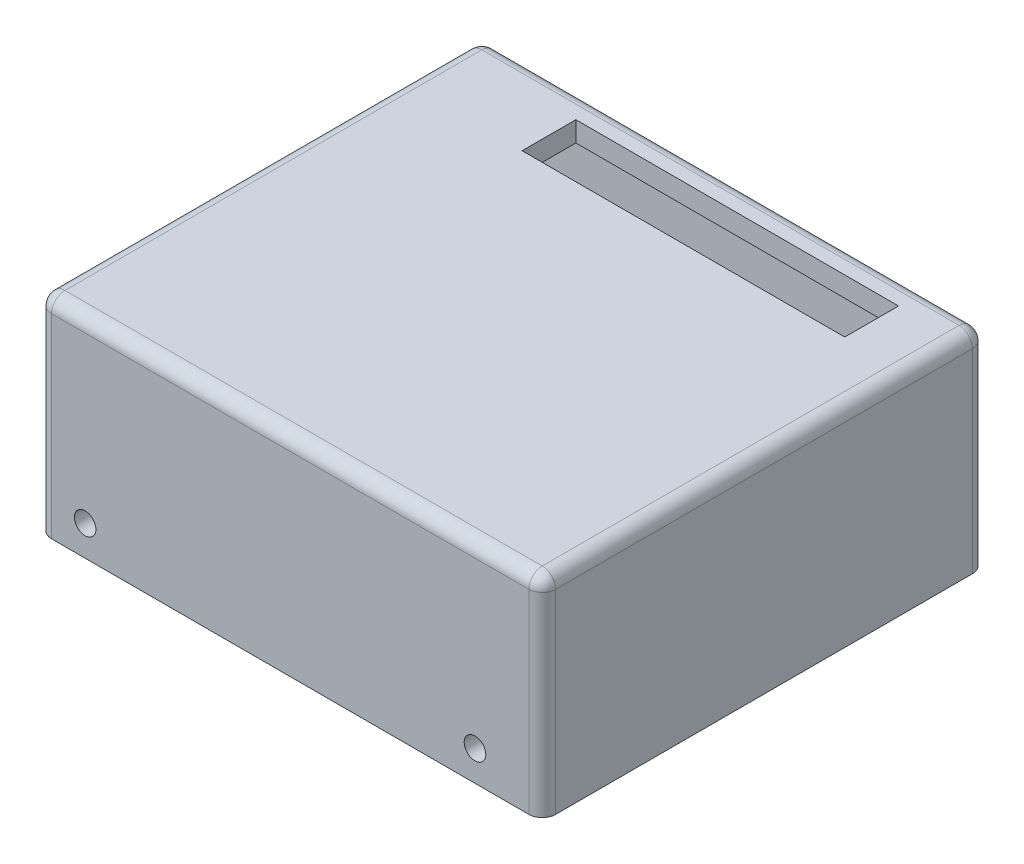
ISO-10303-21;
HEADER;
FILE_DESCRIPTION(('STEP AP214'),'2;1');
FILE_NAME('part.step','',(''),(''),'','','');
FILE_SCHEMA(('AUTOMOTIVE_DESIGN { 1 0 10303 214 1 1 1 1 }'));
ENDSEC;
DATA;
#1=APPLICATION_CONTEXT('core data for automotive mechanical design processes');
#2=APPLICATION_PROTOCOL_DEFINITION('international standard','automotive_design',2000,#1);
#3=PRODUCT_CONTEXT('',#1,'mechanical');
#4=PRODUCT('Part','Part','',(#3));
#5=PRODUCT_RELATED_PRODUCT_CATEGORY('part','',(#4));
#6=PRODUCT_DEFINITION_FORMATION('','',#4);
#7=PRODUCT_DEFINITION_CONTEXT('part definition',#1,'design');
#8=PRODUCT_DEFINITION('design','',#6,#7);
#9=PRODUCT_DEFINITION_SHAPE('','',#8);
#10=(LENGTH_UNIT() NAMED_UNIT(*) SI_UNIT(.MILLI.,.METRE.));
#11=(NAMED_UNIT(*) PLANE_ANGLE_UNIT() SI_UNIT($,.RADIAN.));
#12=(NAMED_UNIT(*) SI_UNIT($,.STERADIAN.) SOLID_ANGLE_UNIT());
#13=UNCERTAINTY_MEASURE_WITH_UNIT(LENGTH_MEASURE(1.E-05),#10,'distance_accuracy_value','');
#14=(GEOMETRIC_REPRESENTATION_CONTEXT(3) GLOBAL_UNCERTAINTY_ASSIGNED_CONTEXT((#13)) GLOBAL_UNIT_ASSIGNED_CONTEXT((#10,
#11,#12)) REPRESENTATION_CONTEXT('',''));
#15=CARTESIAN_POINT('',(0.,0.,0.));
#16=DIRECTION('',(0.,0.,1.));
#17=DIRECTION('',(1.,0.,0.));
#18=AXIS2_PLACEMENT_3D('',#15,#16,#17);
#19=CARTESIAN_POINT('',(3.,24.,0.));
#20=DIRECTION('',(0.,1.,0.));
#21=DIRECTION('',(0.,0.,1.));
#22=AXIS2_PLACEMENT_3D('',#19,#20,#21);
#23=PLANE('',#22);
#24=DIRECTION('',(0.,0.,-1.));
#25=VECTOR('',#24,1.);
#26=CARTESIAN_POINT('',(0.,24.,0.));
#27=LINE('',#26,#25);
#28=CARTESIAN_POINT('',(0.,24.,57.));
#29=VERTEX_POINT('',#28);
#30=CARTESIAN_POINT('',(0.,24.,44.));
#31=VERTEX_POINT('',#30);
#32=EDGE_CURVE('E432',#29,#31,#27,.T.);
#33=ORIENTED_EDGE('',*,*,#32,.T.);
#34=DIRECTION('',(-1.,0.,0.));
#35=VECTOR('',#34,1.);
#36=CARTESIAN_POINT('',(3.,24.,44.));
#37=LINE('',#36,#35);
#38=CARTESIAN_POINT('',(3.,24.,44.));
#39=VERTEX_POINT('',#38);
#40=EDGE_CURVE('E312',#31,#39,#37,.F.);
#41=ORIENTED_EDGE('',*,*,#40,.T.);
#42=DIRECTION('',(0.,0.,-1.));
#43=VECTOR('',#42,1.);
#44=CARTESIAN_POINT('',(3.,24.,0.));
#45=LINE('',#44,#43);
#46=CARTESIAN_POINT('',(3.,24.,57.));
#47=VERTEX_POINT('',#46);
#48=EDGE_CURVE('E254',#47,#39,#45,.T.);
#49=ORIENTED_EDGE('',*,*,#48,.F.);
#50=DIRECTION('',(-1.,0.,0.));
#51=VECTOR('',#50,1.);
#52=CARTESIAN_POINT('',(0.,24.,57.));
#53=LINE('',#52,#51);
#54=EDGE_CURVE('E309',#47,#29,#53,.T.);
#55=ORIENTED_EDGE('',*,*,#54,.T.);
#56=EDGE_LOOP('',(#33,#41,#49,#55));
#57=FACE_BOUND('',#56,.T.);
#58=ADVANCED_FACE('F63',(#57),#23,.F.);
#59=CARTESIAN_POINT('',(0.,28.,58.));
#60=DIRECTION('',(0.,0.,1.));
#61=DIRECTION('',(1.,0.,0.));
#62=AXIS2_PLACEMENT_3D('',#59,#60,#61);
#63=PLANE('',#62);
#64=CARTESIAN_POINT('',(64.9945547397337,4.49861656227081,58.));
#65=DIRECTION('',(0.,0.,-1.));
#66=DIRECTION('',(-1.,0.,0.));
#67=AXIS2_PLACEMENT_3D('',#64,#65,#66);
#68=CIRCLE('',#67,1.60561825233664);
#69=CARTESIAN_POINT('',(63.388936487397,4.49861656227081,58.));
#70=VERTEX_POINT('',#69);
#71=EDGE_CURVE('E405',#70,#70,#68,.T.);
#72=ORIENTED_EDGE('',*,*,#71,.F.);
#73=EDGE_LOOP('',(#72));
#74=FACE_BOUND('',#73,.T.);
#75=CARTESIAN_POINT('',(7.,4.5,58.));
#76=DIRECTION('',(0.,0.,-1.));
#77=DIRECTION('',(-1.,0.,0.));
#78=AXIS2_PLACEMENT_3D('',#75,#76,#77);
#79=CIRCLE('',#78,1.59999999999075);
#80=CARTESIAN_POINT('',(5.40000000000925,4.5,58.));
#81=VERTEX_POINT('',#80);
#82=EDGE_CURVE('E421',#81,#81,#79,.T.);
#83=ORIENTED_EDGE('',*,*,#82,.F.);
#84=EDGE_LOOP('',(#83));
#85=FACE_BOUND('',#84,.T.);
#86=DIRECTION('',(0.,-1.,0.));
#87=VECTOR('',#86,1.);
#88=CARTESIAN_POINT('',(0.,28.,58.));
#89=LINE('',#88,#87);
#90=CARTESIAN_POINT('',(0.,23.,58.));
#91=VERTEX_POINT('',#90);
#92=CARTESIAN_POINT('',(0.,0.,58.));
#93=VERTEX_POINT('',#92);
#94=EDGE_CURVE('E278',#91,#93,#89,.T.);
#95=ORIENTED_EDGE('',*,*,#94,.F.);
#96=DIRECTION('',(-1.,0.,0.));
#97=VECTOR('',#96,1.);
#98=CARTESIAN_POINT('',(3.,23.,58.));
#99=LINE('',#98,#97);
#100=CARTESIAN_POINT('',(3.,23.,58.));
#101=VERTEX_POINT('',#100);
#102=EDGE_CURVE('E252',#91,#101,#99,.F.);
#103=ORIENTED_EDGE('',*,*,#102,.T.);
#104=DIRECTION('',(0.,-1.,0.));
#105=VECTOR('',#104,1.);
#106=CARTESIAN_POINT('',(3.,0.,58.));
#107=LINE('',#106,#105);
#108=CARTESIAN_POINT('',(3.,28.,58.));
#109=VERTEX_POINT('',#108);
#110=EDGE_CURVE('E237',#109,#101,#107,.T.);
#111=ORIENTED_EDGE('',*,*,#110,.F.);
#112=DIRECTION('',(-1.,0.,0.));
#113=VECTOR('',#112,1.);
#114=CARTESIAN_POINT('',(0.,28.,58.));
#115=LINE('',#114,#113);
#116=CARTESIAN_POINT('',(72.,28.,58.));
#117=VERTEX_POINT('',#116);
#118=EDGE_CURVE('E249',#117,#109,#115,.T.);
#119=ORIENTED_EDGE('',*,*,#118,.F.);
#120=DIRECTION('',(0.,-1.,0.));
#121=VECTOR('',#120,1.);
#122=CARTESIAN_POINT('',(72.,28.,58.));
#123=LINE('',#122,#121);
#124=CARTESIAN_POINT('',(72.,0.,58.));
#125=VERTEX_POINT('',#124);
#126=EDGE_CURVE('E281',#117,#125,#123,.T.);
#127=ORIENTED_EDGE('',*,*,#126,.T.);
#128=DIRECTION('',(-1.,0.,0.));
#129=VECTOR('',#128,1.);
#130=CARTESIAN_POINT('',(0.,0.,58.));
#131=LINE('',#130,#129);
#132=EDGE_CURVE('E275',#125,#93,#131,.T.);
#133=ORIENTED_EDGE('',*,*,#132,.T.);
#134=EDGE_LOOP('',(#95,#103,#111,#119,#127,#133));
#135=FACE_BOUND('',#134,.T.);
#136=ADVANCED_FACE('F248',(#74,#85,#135),#63,.F.);
#137=CARTESIAN_POINT('',(0.,28.,-1.99999999999999));
#138=DIRECTION('',(0.,0.,-1.));
#139=DIRECTION('',(-1.,0.,0.));
#140=AXIS2_PLACEMENT_3D('',#137,#138,#139);
#141=PLANE('',#140);
#142=CARTESIAN_POINT('',(64.9945547397337,4.49861656227081,-1.99999999999999));
#143=DIRECTION('',(0.,0.,-1.));
#144=DIRECTION('',(-1.,0.,0.));
#145=AXIS2_PLACEMENT_3D('',#142,#143,#144);
#146=CIRCLE('',#145,1.60561825233664);
#147=CARTESIAN_POINT('',(63.388936487397,4.49861656227081,-1.99999999999999));
#148=VERTEX_POINT('',#147);
#149=EDGE_CURVE('E417',#148,#148,#146,.F.);
#150=ORIENTED_EDGE('',*,*,#149,.F.);
#151=EDGE_LOOP('',(#150));
#152=FACE_BOUND('',#151,.T.);
#153=CARTESIAN_POINT('',(7.,4.5,-1.99999999999999));
#154=DIRECTION('',(0.,0.,-1.));
#155=DIRECTION('',(-1.,0.,0.));
#156=AXIS2_PLACEMENT_3D('',#153,#154,#155);
#157=CIRCLE('',#156,1.59999999999075);
#158=CARTESIAN_POINT('',(5.40000000000925,4.5,-1.99999999999999));
#159=VERTEX_POINT('',#158);
#160=EDGE_CURVE('E409',#159,#159,#157,.F.);
#161=ORIENTED_EDGE('',*,*,#160,.F.);
#162=EDGE_LOOP('',(#161));
#163=FACE_BOUND('',#162,.T.);
#164=DIRECTION('',(0.,1.,0.));
#165=VECTOR('',#164,1.);
#166=CARTESIAN_POINT('',(3.,0.,-1.99999999999999));
#167=LINE('',#166,#165);
#168=CARTESIAN_POINT('',(3.,15.,-1.99999999999999));
#169=VERTEX_POINT('',#168);
#170=CARTESIAN_POINT('',(3.,28.,-1.99999999999999));
#171=VERTEX_POINT('',#170);
#172=EDGE_CURVE('E240',#169,#171,#167,.T.);
#173=ORIENTED_EDGE('',*,*,#172,.F.);
#174=DIRECTION('',(-1.,0.,0.));
#175=VECTOR('',#174,1.);
#176=CARTESIAN_POINT('',(0.,15.,-1.99999999999999));
#177=LINE('',#176,#175);
#178=CARTESIAN_POINT('',(0.,15.,-1.99999999999999));
#179=VERTEX_POINT('',#178);
#180=EDGE_CURVE('E292',#169,#179,#177,.T.);
#181=ORIENTED_EDGE('',*,*,#180,.T.);
#182=DIRECTION('',(0.,-1.,0.));
#183=VECTOR('',#182,1.);
#184=CARTESIAN_POINT('',(0.,28.,-1.99999999999999));
#185=LINE('',#184,#183);
#186=CARTESIAN_POINT('',(0.,0.,-1.99999999999999));
#187=VERTEX_POINT('',#186);
#188=EDGE_CURVE('E259',#179,#187,#185,.T.);
#189=ORIENTED_EDGE('',*,*,#188,.T.);
#190=DIRECTION('',(1.,0.,0.));
#191=VECTOR('',#190,1.);
#192=CARTESIAN_POINT('',(0.,0.,-1.99999999999999));
#193=LINE('',#192,#191);
#194=CARTESIAN_POINT('',(72.,0.,-1.99999999999999));
#195=VERTEX_POINT('',#194);
#196=EDGE_CURVE('E268',#187,#195,#193,.T.);
#197=ORIENTED_EDGE('',*,*,#196,.T.);
#198=DIRECTION('',(0.,-1.,0.));
#199=VECTOR('',#198,1.);
#200=CARTESIAN_POINT('',(72.,28.,-1.99999999999999));
#201=LINE('',#200,#199);
#202=CARTESIAN_POINT('',(72.,28.,-1.99999999999999));
#203=VERTEX_POINT('',#202);
#204=EDGE_CURVE('E262',#203,#195,#201,.T.);
#205=ORIENTED_EDGE('',*,*,#204,.F.);
#206=DIRECTION('',(1.,0.,0.));
#207=VECTOR('',#206,1.);
#208=CARTESIAN_POINT('',(0.,28.,-1.99999999999999));
#209=LINE('',#208,#207);
#210=EDGE_CURVE('E264',#171,#203,#209,.T.);
#211=ORIENTED_EDGE('',*,*,#210,.F.);
#212=EDGE_LOOP('',(#173,#181,#189,#197,#205,#211));
#213=FACE_BOUND('',#212,.T.);
#214=ADVANCED_FACE('F478',(#152,#163,#213),#141,.F.);
#215=CARTESIAN_POINT('',(0.,28.,0.));
#216=DIRECTION('',(0.,-1.,0.));
#217=DIRECTION('',(0.,0.,-1.));
#218=AXIS2_PLACEMENT_3D('',#215,#216,#217);
#219=PLANE('',#218);
#220=DIRECTION('',(-1.,0.,0.));
#221=VECTOR('',#220,1.);
#222=CARTESIAN_POINT('',(66.,28.,7.00000000000001));
#223=LINE('',#222,#221);
#224=CARTESIAN_POINT('',(66.,28.,7.00000000000001));
#225=VERTEX_POINT('',#224);
#226=CARTESIAN_POINT('',(18.,28.,7.00000000000001));
#227=VERTEX_POINT('',#226);
#228=EDGE_CURVE('E445',#225,#227,#223,.T.);
#229=ORIENTED_EDGE('',*,*,#228,.F.);
#230=DIRECTION('',(0.,0.,1.));
#231=VECTOR('',#230,1.);
#232=CARTESIAN_POINT('',(66.,28.,-0.999999999999995));
#233=LINE('',#232,#231);
#234=CARTESIAN_POINT('',(66.,28.,-0.999999999999995));
#235=VERTEX_POINT('',#234);
#236=EDGE_CURVE('E450',#235,#225,#233,.T.);
#237=ORIENTED_EDGE('',*,*,#236,.F.);
#238=DIRECTION('',(-1.,0.,0.));
#239=VECTOR('',#238,1.);
#240=CARTESIAN_POINT('',(66.,28.,-0.999999999999995));
#241=LINE('',#240,#239);
#242=CARTESIAN_POINT('',(18.,28.,-0.999999999999989));
#243=VERTEX_POINT('',#242);
#244=EDGE_CURVE('E463',#235,#243,#241,.T.);
#245=ORIENTED_EDGE('',*,*,#244,.T.);
#246=DIRECTION('',(0.,0.,1.));
#247=VECTOR('',#246,1.);
#248=CARTESIAN_POINT('',(18.,28.,-0.999999999999989));
#249=LINE('',#248,#247);
#250=EDGE_CURVE('E460',#243,#227,#249,.T.);
#251=ORIENTED_EDGE('',*,*,#250,.T.);
#252=EDGE_LOOP('',(#229,#237,#245,#251));
#253=FACE_BOUND('',#252,.T.);
#254=ORIENTED_EDGE('',*,*,#118,.T.);
#255=DIRECTION('',(0.,0.,1.));
#256=VECTOR('',#255,1.);
#257=CARTESIAN_POINT('',(3.,28.,0.));
#258=LINE('',#257,#256);
#259=EDGE_CURVE('E233',#171,#109,#258,.T.);
#260=ORIENTED_EDGE('',*,*,#259,.F.);
#261=ORIENTED_EDGE('',*,*,#210,.T.);
#262=DIRECTION('',(0.,0.,1.));
#263=VECTOR('',#262,1.);
#264=CARTESIAN_POINT('',(72.,28.,58.));
#265=LINE('',#264,#263);
#266=EDGE_CURVE('E258',#203,#117,#265,.T.);
#267=ORIENTED_EDGE('',*,*,#266,.T.);
#268=EDGE_LOOP('',(#254,#260,#261,#267));
#269=FACE_BOUND('',#268,.T.);
#270=ADVANCED_FACE('F256',(#253,#269),#219,.T.);
#271=CARTESIAN_POINT('',(-3.,28.,61.));
#272=DIRECTION('',(0.,0.,1.));
#273=DIRECTION('',(1.,0.,0.));
#274=AXIS2_PLACEMENT_3D('',#271,#272,#273);
#275=PLANE('',#274);
#276=CARTESIAN_POINT('',(64.9945547397337,4.49861656227081,61.));
#277=DIRECTION('',(0.,0.,1.));
#278=DIRECTION('',(1.,0.,0.));
#279=AXIS2_PLACEMENT_3D('',#276,#277,#278);
#280=CIRCLE('',#279,1.60561825233664);
#281=CARTESIAN_POINT('',(66.6001729920703,4.49861656227081,61.));
#282=VERTEX_POINT('',#281);
#283=EDGE_CURVE('E369',#282,#282,#280,.T.);
#284=ORIENTED_EDGE('',*,*,#283,.F.);
#285=EDGE_LOOP('',(#284));
#286=FACE_BOUND('',#285,.T.);
#287=CARTESIAN_POINT('',(7.,4.5,61.));
#288=DIRECTION('',(0.,0.,1.));
#289=DIRECTION('',(1.,0.,0.));
#290=AXIS2_PLACEMENT_3D('',#287,#288,#289);
#291=CIRCLE('',#290,1.59999999999075);
#292=CARTESIAN_POINT('',(8.59999999999074,4.5,61.));
#293=VERTEX_POINT('',#292);
#294=EDGE_CURVE('E402',#293,#293,#291,.T.);
#295=ORIENTED_EDGE('',*,*,#294,.F.);
#296=EDGE_LOOP('',(#295));
#297=FACE_BOUND('',#296,.T.);
#298=DIRECTION('',(1.,0.,0.));
#299=VECTOR('',#298,1.);
#300=CARTESIAN_POINT('',(0.,29.,61.));
#301=LINE('',#300,#299);
#302=CARTESIAN_POINT('',(73.,29.,61.));
#303=VERTEX_POINT('',#302);
#304=CARTESIAN_POINT('',(2.,29.,61.));
#305=VERTEX_POINT('',#304);
#306=EDGE_CURVE('E336',#303,#305,#301,.F.);
#307=ORIENTED_EDGE('',*,*,#306,.T.);
#308=DIRECTION('',(0.,1.,0.));
#309=VECTOR('',#308,1.);
#310=CARTESIAN_POINT('',(2.,28.,61.));
#311=LINE('',#310,#309);
#312=CARTESIAN_POINT('',(2.,0.,61.));
#313=VERTEX_POINT('',#312);
#314=EDGE_CURVE('E338',#305,#313,#311,.F.);
#315=ORIENTED_EDGE('',*,*,#314,.T.);
#316=DIRECTION('',(-1.,0.,0.));
#317=VECTOR('',#316,1.);
#318=CARTESIAN_POINT('',(-3.,0.,61.));
#319=LINE('',#318,#317);
#320=CARTESIAN_POINT('',(73.,0.,61.));
#321=VERTEX_POINT('',#320);
#322=EDGE_CURVE('E280',#321,#313,#319,.T.);
#323=ORIENTED_EDGE('',*,*,#322,.F.);
#324=DIRECTION('',(0.,-1.,0.));
#325=VECTOR('',#324,1.);
#326=CARTESIAN_POINT('',(73.,28.,61.));
#327=LINE('',#326,#325);
#328=EDGE_CURVE('E334',#321,#303,#327,.F.);
#329=ORIENTED_EDGE('',*,*,#328,.T.);
#330=EDGE_LOOP('',(#307,#315,#323,#329));
#331=FACE_BOUND('',#330,.T.);
#332=ADVANCED_FACE('F565',(#286,#297,#331),#275,.T.);
#333=CARTESIAN_POINT('',(-3.,28.,-4.99999999999999));
#334=DIRECTION('',(0.,0.,-1.));
#335=DIRECTION('',(-1.,0.,0.));
#336=AXIS2_PLACEMENT_3D('',#333,#334,#335);
#337=PLANE('',#336);
#338=CARTESIAN_POINT('',(64.9945547397337,4.49861656227081,-5.));
#339=DIRECTION('',(0.,0.,-1.));
#340=DIRECTION('',(-1.,0.,0.));
#341=AXIS2_PLACEMENT_3D('',#338,#339,#340);
#342=CIRCLE('',#341,1.60561825233664);
#343=CARTESIAN_POINT('',(63.388936487397,4.49861656227081,-5.));
#344=VERTEX_POINT('',#343);
#345=EDGE_CURVE('E67',#344,#344,#342,.F.);
#346=ORIENTED_EDGE('',*,*,#345,.T.);
#347=EDGE_LOOP('',(#346));
#348=FACE_BOUND('',#347,.T.);
#349=CARTESIAN_POINT('',(7.,4.5,-5.));
#350=DIRECTION('',(0.,0.,-1.));
#351=DIRECTION('',(-1.,0.,0.));
#352=AXIS2_PLACEMENT_3D('',#349,#350,#351);
#353=CIRCLE('',#352,1.59999999999075);
#354=CARTESIAN_POINT('',(5.40000000000925,4.5,-5.));
#355=VERTEX_POINT('',#354);
#356=EDGE_CURVE('E407',#355,#355,#353,.F.);
#357=ORIENTED_EDGE('',*,*,#356,.T.);
#358=EDGE_LOOP('',(#357));
#359=FACE_BOUND('',#358,.T.);
#360=DIRECTION('',(1.,0.,0.));
#361=VECTOR('',#360,1.);
#362=CARTESIAN_POINT('',(-3.,0.,-4.99999999999999));
#363=LINE('',#362,#361);
#364=CARTESIAN_POINT('',(2.,0.,-4.99999999999999));
#365=VERTEX_POINT('',#364);
#366=CARTESIAN_POINT('',(73.,0.,-5.));
#367=VERTEX_POINT('',#366);
#368=EDGE_CURVE('E286',#365,#367,#363,.T.);
#369=ORIENTED_EDGE('',*,*,#368,.F.);
#370=DIRECTION('',(0.,-1.,0.));
#371=VECTOR('',#370,1.);
#372=CARTESIAN_POINT('',(2.,28.,-4.99999999999999));
#373=LINE('',#372,#371);
#374=CARTESIAN_POINT('',(2.,29.,-4.99999999999999));
#375=VERTEX_POINT('',#374);
#376=EDGE_CURVE('E12',#365,#375,#373,.F.);
#377=ORIENTED_EDGE('',*,*,#376,.T.);
#378=DIRECTION('',(1.,0.,0.));
#379=VECTOR('',#378,1.);
#380=CARTESIAN_POINT('',(75.,29.,-5.));
#381=LINE('',#380,#379);
#382=CARTESIAN_POINT('',(73.,29.,-5.));
#383=VERTEX_POINT('',#382);
#384=EDGE_CURVE('E72',#375,#383,#381,.T.);
#385=ORIENTED_EDGE('',*,*,#384,.T.);
#386=DIRECTION('',(0.,-1.,0.));
#387=VECTOR('',#386,1.);
#388=CARTESIAN_POINT('',(73.,28.,-5.));
#389=LINE('',#388,#387);
#390=EDGE_CURVE('E363',#383,#367,#389,.T.);
#391=ORIENTED_EDGE('',*,*,#390,.T.);
#392=EDGE_LOOP('',(#369,#377,#385,#391));
#393=FACE_BOUND('',#392,.T.);
#394=ADVANCED_FACE('F541',(#348,#359,#393),#337,.T.);
#395=CARTESIAN_POINT('',(0.,0.,0.));
#396=DIRECTION('',(0.,1.,0.));
#397=DIRECTION('',(0.,0.,1.));
#398=AXIS2_PLACEMENT_3D('',#395,#396,#397);
#399=PLANE('',#398);
#400=ORIENTED_EDGE('',*,*,#322,.T.);
#401=CARTESIAN_POINT('',(2.,0.,59.));
#402=DIRECTION('',(0.,1.,0.));
#403=DIRECTION('',(0.,0.,1.));
#404=AXIS2_PLACEMENT_3D('',#401,#402,#403);
#405=CIRCLE('',#404,2.);
#406=CARTESIAN_POINT('',(0.,0.,59.));
#407=VERTEX_POINT('',#406);
#408=EDGE_CURVE('E346',#313,#407,#405,.F.);
#409=ORIENTED_EDGE('',*,*,#408,.T.);
#410=DIRECTION('',(0.,0.,1.));
#411=VECTOR('',#410,1.);
#412=CARTESIAN_POINT('',(0.,0.,-4.99999999999999));
#413=LINE('',#412,#411);
#414=EDGE_CURVE('E440',#93,#407,#413,.T.);
#415=ORIENTED_EDGE('',*,*,#414,.F.);
#416=ORIENTED_EDGE('',*,*,#132,.F.);
#417=DIRECTION('',(0.,0.,1.));
#418=VECTOR('',#417,1.);
#419=CARTESIAN_POINT('',(72.,0.,58.));
#420=LINE('',#419,#418);
#421=EDGE_CURVE('E271',#195,#125,#420,.T.);
#422=ORIENTED_EDGE('',*,*,#421,.F.);
#423=ORIENTED_EDGE('',*,*,#196,.F.);
#424=CARTESIAN_POINT('',(0.,0.,-2.99999999999999));
#425=VERTEX_POINT('',#424);
#426=EDGE_CURVE('E443',#425,#187,#413,.T.);
#427=ORIENTED_EDGE('',*,*,#426,.F.);
#428=CARTESIAN_POINT('',(2.,0.,-2.99999999999999));
#429=DIRECTION('',(0.,1.,0.));
#430=DIRECTION('',(0.,0.,1.));
#431=AXIS2_PLACEMENT_3D('',#428,#429,#430);
#432=CIRCLE('',#431,2.);
#433=EDGE_CURVE('E342',#425,#365,#432,.F.);
#434=ORIENTED_EDGE('',*,*,#433,.T.);
#435=ORIENTED_EDGE('',*,*,#368,.T.);
#436=CARTESIAN_POINT('',(73.,0.,-3.));
#437=DIRECTION('',(0.,1.,0.));
#438=DIRECTION('',(0.,0.,1.));
#439=AXIS2_PLACEMENT_3D('',#436,#437,#438);
#440=CIRCLE('',#439,2.);
#441=CARTESIAN_POINT('',(75.,0.,-3.));
#442=VERTEX_POINT('',#441);
#443=EDGE_CURVE('E340',#367,#442,#440,.F.);
#444=ORIENTED_EDGE('',*,*,#443,.T.);
#445=DIRECTION('',(0.,0.,1.));
#446=VECTOR('',#445,1.);
#447=CARTESIAN_POINT('',(75.,0.,61.));
#448=LINE('',#447,#446);
#449=CARTESIAN_POINT('',(75.,0.,59.));
#450=VERTEX_POINT('',#449);
#451=EDGE_CURVE('E289',#442,#450,#448,.T.);
#452=ORIENTED_EDGE('',*,*,#451,.T.);
#453=CARTESIAN_POINT('',(73.,0.,59.));
#454=DIRECTION('',(0.,1.,0.));
#455=DIRECTION('',(0.,0.,1.));
#456=AXIS2_PLACEMENT_3D('',#453,#454,#455);
#457=CIRCLE('',#456,2.);
#458=EDGE_CURVE('E344',#450,#321,#457,.F.);
#459=ORIENTED_EDGE('',*,*,#458,.T.);
#460=EDGE_LOOP('',(#400,#409,#415,#416,#422,#423,#427,#434,#435,#444,#452,#459));
#461=FACE_BOUND('',#460,.T.);
#462=ADVANCED_FACE('F485',(#461),#399,.F.);
#463=CARTESIAN_POINT('',(0.,31.,0.));
#464=DIRECTION('',(0.,-1.,0.));
#465=DIRECTION('',(0.,0.,-1.));
#466=AXIS2_PLACEMENT_3D('',#463,#464,#465);
#467=PLANE('',#466);
#468=DIRECTION('',(0.,0.,-1.));
#469=VECTOR('',#468,1.);
#470=CARTESIAN_POINT('',(2.,31.,61.));
#471=LINE('',#470,#469);
#472=CARTESIAN_POINT('',(2.,31.,-2.99999999999999));
#473=VERTEX_POINT('',#472);
#474=CARTESIAN_POINT('',(2.,31.,59.));
#475=VERTEX_POINT('',#474);
#476=EDGE_CURVE('E350',#473,#475,#471,.F.);
#477=ORIENTED_EDGE('',*,*,#476,.T.);
#478=DIRECTION('',(1.,0.,0.));
#479=VECTOR('',#478,1.);
#480=CARTESIAN_POINT('',(75.,31.,59.));
#481=LINE('',#480,#479);
#482=CARTESIAN_POINT('',(73.,31.,59.));
#483=VERTEX_POINT('',#482);
#484=EDGE_CURVE('E354',#475,#483,#481,.T.);
#485=ORIENTED_EDGE('',*,*,#484,.T.);
#486=DIRECTION('',(0.,0.,1.));
#487=VECTOR('',#486,1.);
#488=CARTESIAN_POINT('',(73.,31.,-5.));
#489=LINE('',#488,#487);
#490=CARTESIAN_POINT('',(73.,31.,-3.));
#491=VERTEX_POINT('',#490);
#492=EDGE_CURVE('E352',#483,#491,#489,.F.);
#493=ORIENTED_EDGE('',*,*,#492,.T.);
#494=DIRECTION('',(1.,0.,0.));
#495=VECTOR('',#494,1.);
#496=CARTESIAN_POINT('',(0.,31.,-2.99999999999999));
#497=LINE('',#496,#495);
#498=EDGE_CURVE('E348',#491,#473,#497,.F.);
#499=ORIENTED_EDGE('',*,*,#498,.T.);
#500=EDGE_LOOP('',(#477,#485,#493,#499));
#501=FACE_BOUND('',#500,.T.);
#502=DIRECTION('',(0.,0.,1.));
#503=VECTOR('',#502,1.);
#504=CARTESIAN_POINT('',(66.,31.,-0.999999999999995));
#505=LINE('',#504,#503);
#506=CARTESIAN_POINT('',(66.,31.,-0.999999999999995));
#507=VERTEX_POINT('',#506);
#508=CARTESIAN_POINT('',(66.,31.,7.00000000000001));
#509=VERTEX_POINT('',#508);
#510=EDGE_CURVE('E455',#507,#509,#505,.T.);
#511=ORIENTED_EDGE('',*,*,#510,.T.);
#512=DIRECTION('',(-1.,0.,0.));
#513=VECTOR('',#512,1.);
#514=CARTESIAN_POINT('',(66.,31.,7.00000000000001));
#515=LINE('',#514,#513);
#516=CARTESIAN_POINT('',(18.,31.,7.00000000000001));
#517=VERTEX_POINT('',#516);
#518=EDGE_CURVE('E446',#509,#517,#515,.T.);
#519=ORIENTED_EDGE('',*,*,#518,.T.);
#520=DIRECTION('',(0.,0.,1.));
#521=VECTOR('',#520,1.);
#522=CARTESIAN_POINT('',(18.,31.,-0.999999999999989));
#523=LINE('',#522,#521);
#524=CARTESIAN_POINT('',(18.,31.,-0.999999999999989));
#525=VERTEX_POINT('',#524);
#526=EDGE_CURVE('E449',#525,#517,#523,.T.);
#527=ORIENTED_EDGE('',*,*,#526,.F.);
#528=DIRECTION('',(-1.,0.,0.));
#529=VECTOR('',#528,1.);
#530=CARTESIAN_POINT('',(66.,31.,-0.999999999999995));
#531=LINE('',#530,#529);
#532=EDGE_CURVE('E452',#507,#525,#531,.T.);
#533=ORIENTED_EDGE('',*,*,#532,.F.);
#534=EDGE_LOOP('',(#511,#519,#527,#533));
#535=FACE_BOUND('',#534,.T.);
#536=ADVANCED_FACE('F577',(#501,#535),#467,.F.);
#537=CARTESIAN_POINT('',(75.,28.,61.));
#538=DIRECTION('',(1.,0.,0.));
#539=DIRECTION('',(0.,0.,-1.));
#540=AXIS2_PLACEMENT_3D('',#537,#538,#539);
#541=PLANE('',#540);
#542=DIRECTION('',(0.,0.,1.));
#543=VECTOR('',#542,1.);
#544=CARTESIAN_POINT('',(75.,29.,61.));
#545=LINE('',#544,#543);
#546=CARTESIAN_POINT('',(75.,29.,-3.));
#547=VERTEX_POINT('',#546);
#548=CARTESIAN_POINT('',(75.,29.,59.));
#549=VERTEX_POINT('',#548);
#550=EDGE_CURVE('E359',#547,#549,#545,.T.);
#551=ORIENTED_EDGE('',*,*,#550,.T.);
#552=DIRECTION('',(0.,-1.,0.));
#553=VECTOR('',#552,1.);
#554=CARTESIAN_POINT('',(75.,28.,59.));
#555=LINE('',#554,#553);
#556=EDGE_CURVE('E361',#549,#450,#555,.T.);
#557=ORIENTED_EDGE('',*,*,#556,.T.);
#558=ORIENTED_EDGE('',*,*,#451,.F.);
#559=DIRECTION('',(0.,-1.,0.));
#560=VECTOR('',#559,1.);
#561=CARTESIAN_POINT('',(75.,28.,-3.));
#562=LINE('',#561,#560);
#563=EDGE_CURVE('E357',#442,#547,#562,.F.);
#564=ORIENTED_EDGE('',*,*,#563,.T.);
#565=EDGE_LOOP('',(#551,#557,#558,#564));
#566=FACE_BOUND('',#565,.T.);
#567=ADVANCED_FACE('F545',(#566),#541,.T.);
#568=CARTESIAN_POINT('',(72.,28.,58.));
#569=DIRECTION('',(1.,0.,0.));
#570=DIRECTION('',(0.,0.,-1.));
#571=AXIS2_PLACEMENT_3D('',#568,#569,#570);
#572=PLANE('',#571);
#573=ORIENTED_EDGE('',*,*,#421,.T.);
#574=ORIENTED_EDGE('',*,*,#126,.F.);
#575=ORIENTED_EDGE('',*,*,#266,.F.);
#576=ORIENTED_EDGE('',*,*,#204,.T.);
#577=EDGE_LOOP('',(#573,#574,#575,#576));
#578=FACE_BOUND('',#577,.T.);
#579=ADVANCED_FACE('F477',(#578),#572,.F.);
#580=CARTESIAN_POINT('',(66.,31.,7.00000000000001));
#581=DIRECTION('',(0.,0.,1.));
#582=DIRECTION('',(1.,0.,0.));
#583=AXIS2_PLACEMENT_3D('',#580,#581,#582);
#584=PLANE('',#583);
#585=ORIENTED_EDGE('',*,*,#228,.T.);
#586=DIRECTION('',(0.,-1.,0.));
#587=VECTOR('',#586,1.);
#588=CARTESIAN_POINT('',(18.,31.,7.00000000000001));
#589=LINE('',#588,#587);
#590=EDGE_CURVE('E458',#517,#227,#589,.T.);
#591=ORIENTED_EDGE('',*,*,#590,.F.);
#592=ORIENTED_EDGE('',*,*,#518,.F.);
#593=DIRECTION('',(0.,-1.,0.));
#594=VECTOR('',#593,1.);
#595=CARTESIAN_POINT('',(66.,31.,7.00000000000001));
#596=LINE('',#595,#594);
#597=EDGE_CURVE('E272',#509,#225,#596,.T.);
#598=ORIENTED_EDGE('',*,*,#597,.T.);
#599=EDGE_LOOP('',(#585,#591,#592,#598));
#600=FACE_BOUND('',#599,.T.);
#601=ADVANCED_FACE('F592',(#600),#584,.F.);
#602=CARTESIAN_POINT('',(66.,31.,-0.999999999999995));
#603=DIRECTION('',(1.,0.,0.));
#604=DIRECTION('',(0.,0.,-1.));
#605=AXIS2_PLACEMENT_3D('',#602,#603,#604);
#606=PLANE('',#605);
#607=ORIENTED_EDGE('',*,*,#236,.T.);
#608=ORIENTED_EDGE('',*,*,#597,.F.);
#609=ORIENTED_EDGE('',*,*,#510,.F.);
#610=DIRECTION('',(0.,-1.,0.));
#611=VECTOR('',#610,1.);
#612=CARTESIAN_POINT('',(66.,31.,-0.999999999999995));
#613=LINE('',#612,#611);
#614=EDGE_CURVE('E469',#507,#235,#613,.T.);
#615=ORIENTED_EDGE('',*,*,#614,.T.);
#616=EDGE_LOOP('',(#607,#608,#609,#615));
#617=FACE_BOUND('',#616,.T.);
#618=ADVANCED_FACE('F586',(#617),#606,.F.);
#619=CARTESIAN_POINT('',(66.,31.,-0.999999999999995));
#620=DIRECTION('',(0.,0.,1.));
#621=DIRECTION('',(1.,0.,0.));
#622=AXIS2_PLACEMENT_3D('',#619,#620,#621);
#623=PLANE('',#622);
#624=ORIENTED_EDGE('',*,*,#244,.F.);
#625=ORIENTED_EDGE('',*,*,#614,.F.);
#626=ORIENTED_EDGE('',*,*,#532,.T.);
#627=DIRECTION('',(0.,-1.,0.));
#628=VECTOR('',#627,1.);
#629=CARTESIAN_POINT('',(18.,31.,-0.999999999999989));
#630=LINE('',#629,#628);
#631=EDGE_CURVE('E471',#525,#243,#630,.T.);
#632=ORIENTED_EDGE('',*,*,#631,.T.);
#633=EDGE_LOOP('',(#624,#625,#626,#632));
#634=FACE_BOUND('',#633,.T.);
#635=ADVANCED_FACE('F598',(#634),#623,.T.);
#636=CARTESIAN_POINT('',(18.,31.,-0.999999999999989));
#637=DIRECTION('',(1.,0.,0.));
#638=DIRECTION('',(0.,0.,-1.));
#639=AXIS2_PLACEMENT_3D('',#636,#637,#638);
#640=PLANE('',#639);
#641=ORIENTED_EDGE('',*,*,#250,.F.);
#642=ORIENTED_EDGE('',*,*,#631,.F.);
#643=ORIENTED_EDGE('',*,*,#526,.T.);
#644=ORIENTED_EDGE('',*,*,#590,.T.);
#645=EDGE_LOOP('',(#641,#642,#643,#644));
#646=FACE_BOUND('',#645,.T.);
#647=ADVANCED_FACE('F595',(#646),#640,.T.);
#648=CARTESIAN_POINT('',(0.,0.,0.));
#649=DIRECTION('',(-1.,0.,0.));
#650=DIRECTION('',(0.,0.,1.));
#651=AXIS2_PLACEMENT_3D('',#648,#649,#650);
#652=PLANE('',#651);
#653=ORIENTED_EDGE('',*,*,#414,.T.);
#654=DIRECTION('',(0.,1.,0.));
#655=VECTOR('',#654,1.);
#656=CARTESIAN_POINT('',(0.,0.,59.));
#657=LINE('',#656,#655);
#658=CARTESIAN_POINT('',(0.,29.,59.));
#659=VERTEX_POINT('',#658);
#660=EDGE_CURVE('E331',#407,#659,#657,.T.);
#661=ORIENTED_EDGE('',*,*,#660,.T.);
#662=DIRECTION('',(0.,0.,-1.));
#663=VECTOR('',#662,1.);
#664=CARTESIAN_POINT('',(0.,29.,-4.99999999999999));
#665=LINE('',#664,#663);
#666=CARTESIAN_POINT('',(0.,29.,-2.99999999999999));
#667=VERTEX_POINT('',#666);
#668=EDGE_CURVE('E329',#659,#667,#665,.T.);
#669=ORIENTED_EDGE('',*,*,#668,.T.);
#670=DIRECTION('',(0.,-1.,0.));
#671=VECTOR('',#670,1.);
#672=CARTESIAN_POINT('',(0.,0.,-2.99999999999999));
#673=LINE('',#672,#671);
#674=EDGE_CURVE('E327',#667,#425,#673,.T.);
#675=ORIENTED_EDGE('',*,*,#674,.T.);
#676=ORIENTED_EDGE('',*,*,#426,.T.);
#677=ORIENTED_EDGE('',*,*,#188,.F.);
#678=CARTESIAN_POINT('',(0.,15.,-0.999999999999995));
#679=DIRECTION('',(-1.,0.,0.));
#680=DIRECTION('',(0.,0.,1.));
#681=AXIS2_PLACEMENT_3D('',#678,#679,#680);
#682=CIRCLE('',#681,1.);
#683=CARTESIAN_POINT('',(0.,16.,-0.999999999999995));
#684=VERTEX_POINT('',#683);
#685=EDGE_CURVE('E315',#179,#684,#682,.F.);
#686=ORIENTED_EDGE('',*,*,#685,.T.);
#687=DIRECTION('',(0.,0.,1.));
#688=VECTOR('',#687,1.);
#689=CARTESIAN_POINT('',(0.,16.,0.));
#690=LINE('',#689,#688);
#691=CARTESIAN_POINT('',(0.,16.,42.));
#692=VERTEX_POINT('',#691);
#693=EDGE_CURVE('E429',#684,#692,#690,.T.);
#694=ORIENTED_EDGE('',*,*,#693,.T.);
#695=CARTESIAN_POINT('',(0.,17.,42.));
#696=DIRECTION('',(-1.,0.,0.));
#697=DIRECTION('',(0.,0.,1.));
#698=AXIS2_PLACEMENT_3D('',#695,#696,#697);
#699=CIRCLE('',#698,1.);
#700=CARTESIAN_POINT('',(0.,17.,43.));
#701=VERTEX_POINT('',#700);
#702=EDGE_CURVE('E300',#692,#701,#699,.T.);
#703=ORIENTED_EDGE('',*,*,#702,.T.);
#704=DIRECTION('',(0.,-1.,0.));
#705=VECTOR('',#704,1.);
#706=CARTESIAN_POINT('',(0.,0.,43.));
#707=LINE('',#706,#705);
#708=CARTESIAN_POINT('',(0.,23.,43.));
#709=VERTEX_POINT('',#708);
#710=EDGE_CURVE('E401',#709,#701,#707,.T.);
#711=ORIENTED_EDGE('',*,*,#710,.F.);
#712=CARTESIAN_POINT('',(0.,23.,44.));
#713=DIRECTION('',(-1.,0.,0.));
#714=DIRECTION('',(0.,0.,1.));
#715=AXIS2_PLACEMENT_3D('',#712,#713,#714);
#716=CIRCLE('',#715,1.);
#717=EDGE_CURVE('E319',#709,#31,#716,.F.);
#718=ORIENTED_EDGE('',*,*,#717,.T.);
#719=ORIENTED_EDGE('',*,*,#32,.F.);
#720=CARTESIAN_POINT('',(0.,23.,57.));
#721=DIRECTION('',(-1.,0.,0.));
#722=DIRECTION('',(0.,0.,1.));
#723=AXIS2_PLACEMENT_3D('',#720,#721,#722);
#724=CIRCLE('',#723,1.);
#725=EDGE_CURVE('E323',#29,#91,#724,.F.);
#726=ORIENTED_EDGE('',*,*,#725,.T.);
#727=ORIENTED_EDGE('',*,*,#94,.T.);
#728=EDGE_LOOP('',(#653,#661,#669,#675,#676,#677,#686,#694,#703,#711,#718,#719,#726,#727));
#729=FACE_BOUND('',#728,.T.);
#730=ADVANCED_FACE('F518',(#729),#652,.T.);
#731=CARTESIAN_POINT('',(3.,0.,0.));
#732=DIRECTION('',(-1.,0.,0.));
#733=DIRECTION('',(0.,0.,1.));
#734=AXIS2_PLACEMENT_3D('',#731,#732,#733);
#735=PLANE('',#734);
#736=DIRECTION('',(0.,-1.,0.));
#737=VECTOR('',#736,1.);
#738=CARTESIAN_POINT('',(3.,0.,43.));
#739=LINE('',#738,#737);
#740=CARTESIAN_POINT('',(3.,23.,43.));
#741=VERTEX_POINT('',#740);
#742=CARTESIAN_POINT('',(3.,17.,43.));
#743=VERTEX_POINT('',#742);
#744=EDGE_CURVE('E426',#741,#743,#739,.T.);
#745=ORIENTED_EDGE('',*,*,#744,.T.);
#746=CARTESIAN_POINT('',(3.,17.,42.));
#747=DIRECTION('',(-1.,0.,0.));
#748=DIRECTION('',(0.,0.,1.));
#749=AXIS2_PLACEMENT_3D('',#746,#747,#748);
#750=CIRCLE('',#749,1.);
#751=CARTESIAN_POINT('',(3.,16.,42.));
#752=VERTEX_POINT('',#751);
#753=EDGE_CURVE('E307',#743,#752,#750,.F.);
#754=ORIENTED_EDGE('',*,*,#753,.T.);
#755=DIRECTION('',(0.,0.,1.));
#756=VECTOR('',#755,1.);
#757=CARTESIAN_POINT('',(3.,16.,0.));
#758=LINE('',#757,#756);
#759=CARTESIAN_POINT('',(3.,16.,-0.999999999999995));
#760=VERTEX_POINT('',#759);
#761=EDGE_CURVE('E428',#760,#752,#758,.T.);
#762=ORIENTED_EDGE('',*,*,#761,.F.);
#763=CARTESIAN_POINT('',(3.,15.,-0.999999999999995));
#764=DIRECTION('',(-1.,0.,0.));
#765=DIRECTION('',(0.,0.,1.));
#766=AXIS2_PLACEMENT_3D('',#763,#764,#765);
#767=CIRCLE('',#766,1.);
#768=EDGE_CURVE('E317',#760,#169,#767,.T.);
#769=ORIENTED_EDGE('',*,*,#768,.T.);
#770=ORIENTED_EDGE('',*,*,#172,.T.);
#771=ORIENTED_EDGE('',*,*,#259,.T.);
#772=ORIENTED_EDGE('',*,*,#110,.T.);
#773=CARTESIAN_POINT('',(3.,23.,57.));
#774=DIRECTION('',(-1.,0.,0.));
#775=DIRECTION('',(0.,0.,1.));
#776=AXIS2_PLACEMENT_3D('',#773,#774,#775);
#777=CIRCLE('',#776,1.);
#778=EDGE_CURVE('E325',#101,#47,#777,.T.);
#779=ORIENTED_EDGE('',*,*,#778,.T.);
#780=ORIENTED_EDGE('',*,*,#48,.T.);
#781=CARTESIAN_POINT('',(3.,23.,44.));
#782=DIRECTION('',(-1.,0.,0.));
#783=DIRECTION('',(0.,0.,1.));
#784=AXIS2_PLACEMENT_3D('',#781,#782,#783);
#785=CIRCLE('',#784,1.);
#786=EDGE_CURVE('E321',#39,#741,#785,.T.);
#787=ORIENTED_EDGE('',*,*,#786,.T.);
#788=EDGE_LOOP('',(#745,#754,#762,#769,#770,#771,#772,#779,#780,#787));
#789=FACE_BOUND('',#788,.T.);
#790=ADVANCED_FACE('F236',(#789),#735,.F.);
#791=CARTESIAN_POINT('',(3.,0.,43.));
#792=DIRECTION('',(0.,0.,-1.));
#793=DIRECTION('',(-1.,0.,0.));
#794=AXIS2_PLACEMENT_3D('',#791,#792,#793);
#795=PLANE('',#794);
#796=ORIENTED_EDGE('',*,*,#710,.T.);
#797=DIRECTION('',(-1.,0.,0.));
#798=VECTOR('',#797,1.);
#799=CARTESIAN_POINT('',(3.,17.,43.));
#800=LINE('',#799,#798);
#801=EDGE_CURVE('E305',#701,#743,#800,.F.);
#802=ORIENTED_EDGE('',*,*,#801,.T.);
#803=ORIENTED_EDGE('',*,*,#744,.F.);
#804=DIRECTION('',(-1.,0.,0.));
#805=VECTOR('',#804,1.);
#806=CARTESIAN_POINT('',(0.,23.,43.));
#807=LINE('',#806,#805);
#808=EDGE_CURVE('E302',#741,#709,#807,.T.);
#809=ORIENTED_EDGE('',*,*,#808,.T.);
#810=EDGE_LOOP('',(#796,#802,#803,#809));
#811=FACE_BOUND('',#810,.T.);
#812=ADVANCED_FACE('F503',(#811),#795,.F.);
#813=CARTESIAN_POINT('',(3.,16.,0.));
#814=DIRECTION('',(0.,-1.,0.));
#815=DIRECTION('',(0.,0.,-1.));
#816=AXIS2_PLACEMENT_3D('',#813,#814,#815);
#817=PLANE('',#816);
#818=ORIENTED_EDGE('',*,*,#693,.F.);
#819=DIRECTION('',(-1.,0.,0.));
#820=VECTOR('',#819,1.);
#821=CARTESIAN_POINT('',(3.,16.,-0.999999999999995));
#822=LINE('',#821,#820);
#823=EDGE_CURVE('E298',#684,#760,#822,.F.);
#824=ORIENTED_EDGE('',*,*,#823,.T.);
#825=ORIENTED_EDGE('',*,*,#761,.T.);
#826=DIRECTION('',(-1.,0.,0.));
#827=VECTOR('',#826,1.);
#828=CARTESIAN_POINT('',(0.,16.,42.));
#829=LINE('',#828,#827);
#830=EDGE_CURVE('E295',#752,#692,#829,.T.);
#831=ORIENTED_EDGE('',*,*,#830,.T.);
#832=EDGE_LOOP('',(#818,#824,#825,#831));
#833=FACE_BOUND('',#832,.T.);
#834=ADVANCED_FACE('F513',(#833),#817,.T.);
#835=CARTESIAN_POINT('',(0.,15.,-0.999999999999995));
#836=DIRECTION('',(-1.,0.,0.));
#837=DIRECTION('',(0.,0.,1.));
#838=AXIS2_PLACEMENT_3D('',#835,#836,#837);
#839=CYLINDRICAL_SURFACE('',#838,1.);
#840=ORIENTED_EDGE('',*,*,#768,.F.);
#841=ORIENTED_EDGE('',*,*,#823,.F.);
#842=ORIENTED_EDGE('',*,*,#685,.F.);
#843=ORIENTED_EDGE('',*,*,#180,.F.);
#844=EDGE_LOOP('',(#840,#841,#842,#843));
#845=FACE_BOUND('',#844,.T.);
#846=ADVANCED_FACE('F516',(#845),#839,.F.);
#847=CARTESIAN_POINT('',(3.,17.,42.));
#848=DIRECTION('',(1.,0.,0.));
#849=DIRECTION('',(0.,0.,-1.));
#850=AXIS2_PLACEMENT_3D('',#847,#848,#849);
#851=CYLINDRICAL_SURFACE('',#850,1.);
#852=ORIENTED_EDGE('',*,*,#753,.F.);
#853=ORIENTED_EDGE('',*,*,#801,.F.);
#854=ORIENTED_EDGE('',*,*,#702,.F.);
#855=ORIENTED_EDGE('',*,*,#830,.F.);
#856=EDGE_LOOP('',(#852,#853,#854,#855));
#857=FACE_BOUND('',#856,.T.);
#858=ADVANCED_FACE('F507',(#857),#851,.T.);
#859=CARTESIAN_POINT('',(3.,23.,44.));
#860=DIRECTION('',(1.,0.,0.));
#861=DIRECTION('',(0.,0.,-1.));
#862=AXIS2_PLACEMENT_3D('',#859,#860,#861);
#863=CYLINDRICAL_SURFACE('',#862,1.);
#864=ORIENTED_EDGE('',*,*,#786,.F.);
#865=ORIENTED_EDGE('',*,*,#40,.F.);
#866=ORIENTED_EDGE('',*,*,#717,.F.);
#867=ORIENTED_EDGE('',*,*,#808,.F.);
#868=EDGE_LOOP('',(#864,#865,#866,#867));
#869=FACE_BOUND('',#868,.T.);
#870=ADVANCED_FACE('F498',(#869),#863,.F.);
#871=CARTESIAN_POINT('',(3.,23.,57.));
#872=DIRECTION('',(1.,0.,0.));
#873=DIRECTION('',(0.,0.,-1.));
#874=AXIS2_PLACEMENT_3D('',#871,#872,#873);
#875=CYLINDRICAL_SURFACE('',#874,1.);
#876=ORIENTED_EDGE('',*,*,#778,.F.);
#877=ORIENTED_EDGE('',*,*,#102,.F.);
#878=ORIENTED_EDGE('',*,*,#725,.F.);
#879=ORIENTED_EDGE('',*,*,#54,.F.);
#880=EDGE_LOOP('',(#876,#877,#878,#879));
#881=FACE_BOUND('',#880,.T.);
#882=ADVANCED_FACE('F490',(#881),#875,.F.);
#883=CARTESIAN_POINT('',(73.,28.,-3.));
#884=DIRECTION('',(0.,-1.,0.));
#885=DIRECTION('',(0.,0.,-1.));
#886=AXIS2_PLACEMENT_3D('',#883,#884,#885);
#887=CYLINDRICAL_SURFACE('',#886,2.);
#888=CARTESIAN_POINT('',(73.,29.,-3.));
#889=DIRECTION('',(0.,1.,0.));
#890=DIRECTION('',(0.,0.,1.));
#891=AXIS2_PLACEMENT_3D('',#888,#889,#890);
#892=CIRCLE('',#891,2.);
#893=EDGE_CURVE('E398',#547,#383,#892,.T.);
#894=ORIENTED_EDGE('',*,*,#893,.F.);
#895=ORIENTED_EDGE('',*,*,#563,.F.);
#896=ORIENTED_EDGE('',*,*,#443,.F.);
#897=ORIENTED_EDGE('',*,*,#390,.F.);
#898=EDGE_LOOP('',(#894,#895,#896,#897));
#899=FACE_BOUND('',#898,.T.);
#900=ADVANCED_FACE('F65',(#899),#887,.T.);
#901=CARTESIAN_POINT('',(73.,29.,-3.));
#902=DIRECTION('',(0.,0.,-1.));
#903=DIRECTION('',(-1.,0.,0.));
#904=AXIS2_PLACEMENT_3D('',#901,#902,#903);
#905=SPHERICAL_SURFACE('',#904,2.);
#906=CARTESIAN_POINT('',(73.,29.,-3.));
#907=DIRECTION('',(0.,0.,-1.));
#908=DIRECTION('',(-1.,0.,0.));
#909=AXIS2_PLACEMENT_3D('',#906,#907,#908);
#910=CIRCLE('',#909,2.);
#911=EDGE_CURVE('E392',#547,#491,#910,.F.);
#912=ORIENTED_EDGE('',*,*,#911,.F.);
#913=ORIENTED_EDGE('',*,*,#893,.T.);
#914=CARTESIAN_POINT('',(73.,29.,-3.));
#915=DIRECTION('',(1.,0.,0.));
#916=DIRECTION('',(0.,0.,-1.));
#917=AXIS2_PLACEMENT_3D('',#914,#915,#916);
#918=CIRCLE('',#917,2.);
#919=EDGE_CURVE('E395',#491,#383,#918,.F.);
#920=ORIENTED_EDGE('',*,*,#919,.F.);
#921=EDGE_LOOP('',(#912,#913,#920));
#922=FACE_BOUND('',#921,.T.);
#923=ADVANCED_FACE('F535',(#922),#905,.T.);
#924=CARTESIAN_POINT('',(2.,0.,-2.99999999999999));
#925=DIRECTION('',(0.,-1.,0.));
#926=DIRECTION('',(0.,0.,-1.));
#927=AXIS2_PLACEMENT_3D('',#924,#925,#926);
#928=CYLINDRICAL_SURFACE('',#927,2.);
#929=ORIENTED_EDGE('',*,*,#433,.F.);
#930=ORIENTED_EDGE('',*,*,#674,.F.);
#931=CARTESIAN_POINT('',(2.,29.,-2.99999999999999));
#932=DIRECTION('',(0.,1.,0.));
#933=DIRECTION('',(0.,0.,1.));
#934=AXIS2_PLACEMENT_3D('',#931,#932,#933);
#935=CIRCLE('',#934,2.);
#936=EDGE_CURVE('E389',#375,#667,#935,.T.);
#937=ORIENTED_EDGE('',*,*,#936,.F.);
#938=ORIENTED_EDGE('',*,*,#376,.F.);
#939=EDGE_LOOP('',(#929,#930,#937,#938));
#940=FACE_BOUND('',#939,.T.);
#941=ADVANCED_FACE('F522',(#940),#928,.T.);
#942=CARTESIAN_POINT('',(-3.,29.,-2.99999999999999));
#943=DIRECTION('',(-1.,0.,0.));
#944=DIRECTION('',(0.,0.,1.));
#945=AXIS2_PLACEMENT_3D('',#942,#943,#944);
#946=CYLINDRICAL_SURFACE('',#945,2.);
#947=ORIENTED_EDGE('',*,*,#919,.T.);
#948=ORIENTED_EDGE('',*,*,#384,.F.);
#949=CARTESIAN_POINT('',(2.,29.,-2.99999999999999));
#950=DIRECTION('',(-1.,0.,0.));
#951=DIRECTION('',(0.,0.,1.));
#952=AXIS2_PLACEMENT_3D('',#949,#950,#951);
#953=CIRCLE('',#952,2.);
#954=EDGE_CURVE('E386',#473,#375,#953,.T.);
#955=ORIENTED_EDGE('',*,*,#954,.F.);
#956=ORIENTED_EDGE('',*,*,#498,.F.);
#957=EDGE_LOOP('',(#947,#948,#955,#956));
#958=FACE_BOUND('',#957,.T.);
#959=ADVANCED_FACE('F531',(#958),#946,.T.);
#960=CARTESIAN_POINT('',(73.,29.,61.));
#961=DIRECTION('',(0.,0.,-1.));
#962=DIRECTION('',(-1.,0.,0.));
#963=AXIS2_PLACEMENT_3D('',#960,#961,#962);
#964=CYLINDRICAL_SURFACE('',#963,2.);
#965=ORIENTED_EDGE('',*,*,#911,.T.);
#966=ORIENTED_EDGE('',*,*,#492,.F.);
#967=CARTESIAN_POINT('',(73.,29.,59.));
#968=DIRECTION('',(0.,0.,1.));
#969=DIRECTION('',(1.,0.,0.));
#970=AXIS2_PLACEMENT_3D('',#967,#968,#969);
#971=CIRCLE('',#970,2.);
#972=EDGE_CURVE('E383',#549,#483,#971,.T.);
#973=ORIENTED_EDGE('',*,*,#972,.F.);
#974=ORIENTED_EDGE('',*,*,#550,.F.);
#975=EDGE_LOOP('',(#965,#966,#973,#974));
#976=FACE_BOUND('',#975,.T.);
#977=ADVANCED_FACE('F555',(#976),#964,.T.);
#978=CARTESIAN_POINT('',(73.,28.,59.));
#979=DIRECTION('',(0.,-1.,0.));
#980=DIRECTION('',(0.,0.,-1.));
#981=AXIS2_PLACEMENT_3D('',#978,#979,#980);
#982=CYLINDRICAL_SURFACE('',#981,2.);
#983=ORIENTED_EDGE('',*,*,#458,.F.);
#984=ORIENTED_EDGE('',*,*,#556,.F.);
#985=CARTESIAN_POINT('',(73.,29.,59.));
#986=DIRECTION('',(0.,1.,0.));
#987=DIRECTION('',(0.,0.,1.));
#988=AXIS2_PLACEMENT_3D('',#985,#986,#987);
#989=CIRCLE('',#988,2.);
#990=EDGE_CURVE('E380',#303,#549,#989,.T.);
#991=ORIENTED_EDGE('',*,*,#990,.F.);
#992=ORIENTED_EDGE('',*,*,#328,.F.);
#993=EDGE_LOOP('',(#983,#984,#991,#992));
#994=FACE_BOUND('',#993,.T.);
#995=ADVANCED_FACE('F550',(#994),#982,.T.);
#996=CARTESIAN_POINT('',(2.,29.,-2.99999999999999));
#997=DIRECTION('',(0.,0.,-1.));
#998=DIRECTION('',(-1.,0.,0.));
#999=AXIS2_PLACEMENT_3D('',#996,#997,#998);
#1000=SPHERICAL_SURFACE('',#999,2.);
#1001=ORIENTED_EDGE('',*,*,#954,.T.);
#1002=ORIENTED_EDGE('',*,*,#936,.T.);
#1003=CARTESIAN_POINT('',(2.,29.,-2.99999999999999));
#1004=DIRECTION('',(0.,0.,-1.));
#1005=DIRECTION('',(-1.,0.,0.));
#1006=AXIS2_PLACEMENT_3D('',#1003,#1004,#1005);
#1007=CIRCLE('',#1006,2.);
#1008=EDGE_CURVE('E377',#473,#667,#1007,.F.);
#1009=ORIENTED_EDGE('',*,*,#1008,.F.);
#1010=EDGE_LOOP('',(#1001,#1002,#1009));
#1011=FACE_BOUND('',#1010,.T.);
#1012=ADVANCED_FACE('F527',(#1011),#1000,.T.);
#1013=CARTESIAN_POINT('',(73.,29.,59.));
#1014=DIRECTION('',(1.,0.,0.));
#1015=DIRECTION('',(0.,0.,-1.));
#1016=AXIS2_PLACEMENT_3D('',#1013,#1014,#1015);
#1017=SPHERICAL_SURFACE('',#1016,2.);
#1018=ORIENTED_EDGE('',*,*,#990,.T.);
#1019=ORIENTED_EDGE('',*,*,#972,.T.);
#1020=CARTESIAN_POINT('',(73.,29.,59.));
#1021=DIRECTION('',(1.,0.,0.));
#1022=DIRECTION('',(0.,0.,-1.));
#1023=AXIS2_PLACEMENT_3D('',#1020,#1021,#1022);
#1024=CIRCLE('',#1023,2.);
#1025=EDGE_CURVE('E375',#303,#483,#1024,.F.);
#1026=ORIENTED_EDGE('',*,*,#1025,.F.);
#1027=EDGE_LOOP('',(#1018,#1019,#1026));
#1028=FACE_BOUND('',#1027,.T.);
#1029=ADVANCED_FACE('F557',(#1028),#1017,.T.);
#1030=CARTESIAN_POINT('',(2.,29.,0.));
#1031=DIRECTION('',(0.,0.,1.));
#1032=DIRECTION('',(1.,0.,0.));
#1033=AXIS2_PLACEMENT_3D('',#1030,#1031,#1032);
#1034=CYLINDRICAL_SURFACE('',#1033,2.);
#1035=ORIENTED_EDGE('',*,*,#1008,.T.);
#1036=ORIENTED_EDGE('',*,*,#668,.F.);
#1037=CARTESIAN_POINT('',(2.,29.,59.));
#1038=DIRECTION('',(0.,0.,1.));
#1039=DIRECTION('',(1.,0.,0.));
#1040=AXIS2_PLACEMENT_3D('',#1037,#1038,#1039);
#1041=CIRCLE('',#1040,2.);
#1042=EDGE_CURVE('E372',#475,#659,#1041,.T.);
#1043=ORIENTED_EDGE('',*,*,#1042,.F.);
#1044=ORIENTED_EDGE('',*,*,#476,.F.);
#1045=EDGE_LOOP('',(#1035,#1036,#1043,#1044));
#1046=FACE_BOUND('',#1045,.T.);
#1047=ADVANCED_FACE('F575',(#1046),#1034,.T.);
#1048=CARTESIAN_POINT('',(0.,29.,59.));
#1049=DIRECTION('',(-1.,0.,0.));
#1050=DIRECTION('',(0.,0.,1.));
#1051=AXIS2_PLACEMENT_3D('',#1048,#1049,#1050);
#1052=CYLINDRICAL_SURFACE('',#1051,2.);
#1053=ORIENTED_EDGE('',*,*,#1025,.T.);
#1054=ORIENTED_EDGE('',*,*,#484,.F.);
#1055=CARTESIAN_POINT('',(2.,29.,59.));
#1056=DIRECTION('',(-1.,0.,0.));
#1057=DIRECTION('',(0.,0.,1.));
#1058=AXIS2_PLACEMENT_3D('',#1055,#1056,#1057);
#1059=CIRCLE('',#1058,2.);
#1060=EDGE_CURVE('E368',#305,#475,#1059,.T.);
#1061=ORIENTED_EDGE('',*,*,#1060,.F.);
#1062=ORIENTED_EDGE('',*,*,#306,.F.);
#1063=EDGE_LOOP('',(#1053,#1054,#1061,#1062));
#1064=FACE_BOUND('',#1063,.T.);
#1065=ADVANCED_FACE('F562',(#1064),#1052,.T.);
#1066=CARTESIAN_POINT('',(2.,29.,59.));
#1067=DIRECTION('',(0.,1.,0.));
#1068=DIRECTION('',(0.,0.,1.));
#1069=AXIS2_PLACEMENT_3D('',#1066,#1067,#1068);
#1070=SPHERICAL_SURFACE('',#1069,2.);
#1071=ORIENTED_EDGE('',*,*,#1060,.T.);
#1072=ORIENTED_EDGE('',*,*,#1042,.T.);
#1073=CARTESIAN_POINT('',(2.,29.,59.));
#1074=DIRECTION('',(0.,1.,0.));
#1075=DIRECTION('',(0.,0.,1.));
#1076=AXIS2_PLACEMENT_3D('',#1073,#1074,#1075);
#1077=CIRCLE('',#1076,2.);
#1078=EDGE_CURVE('E366',#305,#659,#1077,.F.);
#1079=ORIENTED_EDGE('',*,*,#1078,.F.);
#1080=EDGE_LOOP('',(#1071,#1072,#1079));
#1081=FACE_BOUND('',#1080,.T.);
#1082=ADVANCED_FACE('F679',(#1081),#1070,.T.);
#1083=CARTESIAN_POINT('',(2.,0.,59.));
#1084=DIRECTION('',(0.,1.,0.));
#1085=DIRECTION('',(0.,0.,1.));
#1086=AXIS2_PLACEMENT_3D('',#1083,#1084,#1085);
#1087=CYLINDRICAL_SURFACE('',#1086,2.);
#1088=ORIENTED_EDGE('',*,*,#408,.F.);
#1089=ORIENTED_EDGE('',*,*,#314,.F.);
#1090=ORIENTED_EDGE('',*,*,#1078,.T.);
#1091=ORIENTED_EDGE('',*,*,#660,.F.);
#1092=EDGE_LOOP('',(#1088,#1089,#1090,#1091));
#1093=FACE_BOUND('',#1092,.T.);
#1094=ADVANCED_FACE('F570',(#1093),#1087,.T.);
#1095=CARTESIAN_POINT('',(7.,4.5,75.));
#1096=DIRECTION('',(0.,0.,-1.));
#1097=DIRECTION('',(-1.,0.,0.));
#1098=AXIS2_PLACEMENT_3D('',#1095,#1096,#1097);
#1099=CYLINDRICAL_SURFACE('',#1098,1.59999999999075);
#1100=ORIENTED_EDGE('',*,*,#294,.T.);
#1101=EDGE_LOOP('',(#1100));
#1102=FACE_BOUND('',#1101,.T.);
#1103=ORIENTED_EDGE('',*,*,#82,.T.);
#1104=EDGE_LOOP('',(#1103));
#1105=FACE_BOUND('',#1104,.T.);
#1106=ADVANCED_FACE('F629',(#1102,#1105),#1099,.F.);
#1107=CARTESIAN_POINT('',(64.9945547397337,4.49861656227081,75.));
#1108=DIRECTION('',(0.,0.,-1.));
#1109=DIRECTION('',(-1.,0.,0.));
#1110=AXIS2_PLACEMENT_3D('',#1107,#1108,#1109);
#1111=CYLINDRICAL_SURFACE('',#1110,1.60561825233664);
#1112=ORIENTED_EDGE('',*,*,#283,.T.);
#1113=EDGE_LOOP('',(#1112));
#1114=FACE_BOUND('',#1113,.T.);
#1115=ORIENTED_EDGE('',*,*,#71,.T.);
#1116=EDGE_LOOP('',(#1115));
#1117=FACE_BOUND('',#1116,.T.);
#1118=ADVANCED_FACE('F632',(#1114,#1117),#1111,.F.);
#1119=CARTESIAN_POINT('',(7.,4.5,-45.));
#1120=DIRECTION('',(0.,0.,1.));
#1121=DIRECTION('',(1.,0.,0.));
#1122=AXIS2_PLACEMENT_3D('',#1119,#1120,#1121);
#1123=CYLINDRICAL_SURFACE('',#1122,1.59999999999075);
#1124=ORIENTED_EDGE('',*,*,#356,.F.);
#1125=EDGE_LOOP('',(#1124));
#1126=FACE_BOUND('',#1125,.T.);
#1127=ORIENTED_EDGE('',*,*,#160,.T.);
#1128=EDGE_LOOP('',(#1127));
#1129=FACE_BOUND('',#1128,.T.);
#1130=ADVANCED_FACE('F636',(#1126,#1129),#1123,.F.);
#1131=CARTESIAN_POINT('',(64.9945547397337,4.49861656227081,-45.));
#1132=DIRECTION('',(0.,0.,1.));
#1133=DIRECTION('',(1.,0.,0.));
#1134=AXIS2_PLACEMENT_3D('',#1131,#1132,#1133);
#1135=CYLINDRICAL_SURFACE('',#1134,1.60561825233664);
#1136=ORIENTED_EDGE('',*,*,#345,.F.);
#1137=EDGE_LOOP('',(#1136));
#1138=FACE_BOUND('',#1137,.T.);
#1139=ORIENTED_EDGE('',*,*,#149,.T.);
#1140=EDGE_LOOP('',(#1139));
#1141=FACE_BOUND('',#1140,.T.);
#1142=ADVANCED_FACE('F640',(#1138,#1141),#1135,.F.);
#1143=CLOSED_SHELL('',(#58,#136,#214,#270,#332,#394,#462,#536,#567,#579,#601,#618,#635,#647,
#730,#790,#812,#834,#846,#858,#870,#882,#900,#923,#941,#959,#977,#995,#1012,#1029,#1047,#1065,
#1082,#1094,#1106,#1118,#1130,#1142));
#1144=MANIFOLD_SOLID_BREP('B2',#1143);
#1145=ADVANCED_BREP_SHAPE_REPRESENTATION('',(#18,#1144),#14);
#1146=SHAPE_DEFINITION_REPRESENTATION(#9,#1145);
ENDSEC;
END-ISO-10303-21;
